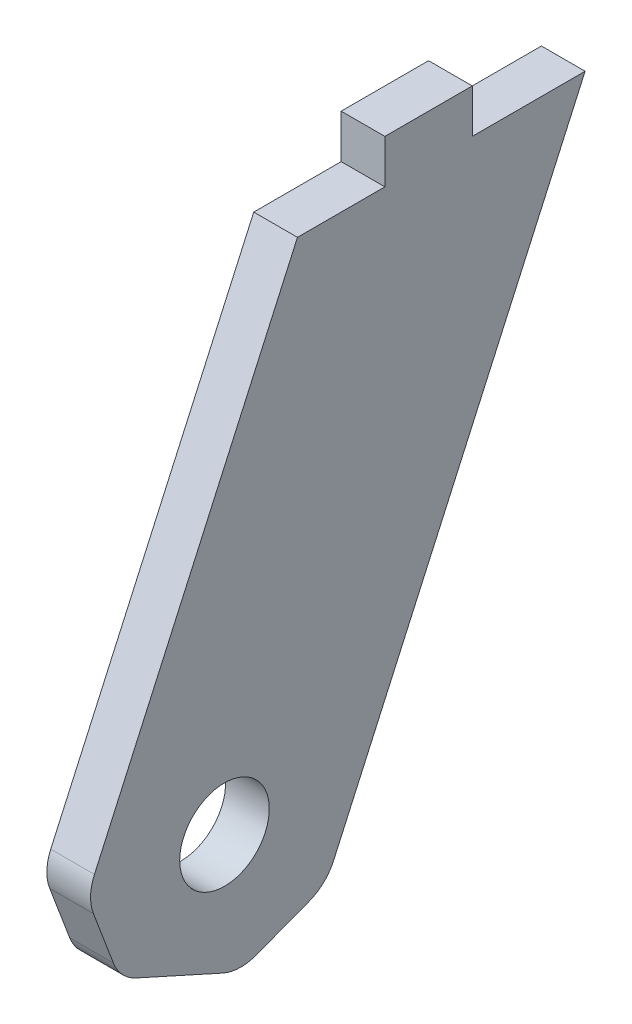
ISO-10303-21;
HEADER;
FILE_DESCRIPTION(('STEP AP214'),'2;1');
FILE_NAME('part.step','',(''),(''),'','','');
FILE_SCHEMA(('AUTOMOTIVE_DESIGN { 1 0 10303 214 1 1 1 1 }'));
ENDSEC;
DATA;
#1=APPLICATION_CONTEXT('core data for automotive mechanical design processes');
#2=APPLICATION_PROTOCOL_DEFINITION('international standard','automotive_design',2000,#1);
#3=PRODUCT_CONTEXT('',#1,'mechanical');
#4=PRODUCT('Part','Part','',(#3));
#5=PRODUCT_RELATED_PRODUCT_CATEGORY('part','',(#4));
#6=PRODUCT_DEFINITION_FORMATION('','',#4);
#7=PRODUCT_DEFINITION_CONTEXT('part definition',#1,'design');
#8=PRODUCT_DEFINITION('design','',#6,#7);
#9=PRODUCT_DEFINITION_SHAPE('','',#8);
#10=(LENGTH_UNIT() NAMED_UNIT(*) SI_UNIT(.MILLI.,.METRE.));
#11=(NAMED_UNIT(*) PLANE_ANGLE_UNIT() SI_UNIT($,.RADIAN.));
#12=(NAMED_UNIT(*) SI_UNIT($,.STERADIAN.) SOLID_ANGLE_UNIT());
#13=UNCERTAINTY_MEASURE_WITH_UNIT(LENGTH_MEASURE(1.E-05),#10,'distance_accuracy_value','');
#14=(GEOMETRIC_REPRESENTATION_CONTEXT(3) GLOBAL_UNCERTAINTY_ASSIGNED_CONTEXT((#13)) GLOBAL_UNIT_ASSIGNED_CONTEXT((#10,
#11,#12)) REPRESENTATION_CONTEXT('',''));
#15=CARTESIAN_POINT('',(0.,0.,0.));
#16=DIRECTION('',(0.,0.,1.));
#17=DIRECTION('',(1.,0.,0.));
#18=AXIS2_PLACEMENT_3D('',#15,#16,#17);
#19=CARTESIAN_POINT('',(665.,-480.,-565.908733529814));
#20=DIRECTION('',(0.,1.,0.));
#21=DIRECTION('',(0.,0.,1.));
#22=AXIS2_PLACEMENT_3D('',#19,#20,#21);
#23=PLANE('',#22);
#24=DIRECTION('',(0.,0.,1.));
#25=VECTOR('',#24,1.);
#26=CARTESIAN_POINT('',(675.,-480.,-565.908733529814));
#27=LINE('',#26,#25);
#28=CARTESIAN_POINT('',(675.,-480.,-520.091266470186));
#29=VERTEX_POINT('',#28);
#30=CARTESIAN_POINT('',(675.,-480.,-500.091266470186));
#31=VERTEX_POINT('',#30);
#32=EDGE_CURVE('E165',#29,#31,#27,.T.);
#33=ORIENTED_EDGE('',*,*,#32,.F.);
#34=CARTESIAN_POINT('',(675.,-480.,-520.091266470186));
#35=CARTESIAN_POINT('',(665.,-480.,-520.091266470186));
#36=B_SPLINE_CURVE_WITH_KNOTS('',1,(#34,#35),.UNSPECIFIED.,.F.,.F.,(2,2),(0.,0.166666666666667),.UNSPECIFIED.);
#37=CARTESIAN_POINT('',(665.,-480.,-520.091266470186));
#38=VERTEX_POINT('',#37);
#39=EDGE_CURVE('E153',#29,#38,#36,.T.);
#40=ORIENTED_EDGE('',*,*,#39,.T.);
#41=DIRECTION('',(0.,0.,1.));
#42=VECTOR('',#41,1.);
#43=CARTESIAN_POINT('',(665.,-480.,-565.908733529814));
#44=LINE('',#43,#42);
#45=CARTESIAN_POINT('',(665.,-480.,-500.091266470186));
#46=VERTEX_POINT('',#45);
#47=EDGE_CURVE('E163',#38,#46,#44,.T.);
#48=ORIENTED_EDGE('',*,*,#47,.T.);
#49=DIRECTION('',(1.,0.,0.));
#50=VECTOR('',#49,1.);
#51=CARTESIAN_POINT('',(665.,-480.,-500.091266470186));
#52=LINE('',#51,#50);
#53=EDGE_CURVE('E320',#46,#31,#52,.T.);
#54=ORIENTED_EDGE('',*,*,#53,.T.);
#55=EDGE_LOOP('',(#33,#40,#48,#54));
#56=FACE_BOUND('',#55,.T.);
#57=ADVANCED_FACE('F41',(#56),#23,.T.);
#58=CARTESIAN_POINT('',(665.,-480.,-565.908733529814));
#59=VERTEX_POINT('',#58);
#60=CARTESIAN_POINT('',(665.,-480.,-540.091266470186));
#61=VERTEX_POINT('',#60);
#62=EDGE_CURVE('E170',#59,#61,#44,.T.);
#63=ORIENTED_EDGE('',*,*,#62,.T.);
#64=CARTESIAN_POINT('',(665.,-480.,-540.091266470186));
#65=CARTESIAN_POINT('',(675.,-480.,-540.091266470186));
#66=B_SPLINE_CURVE_WITH_KNOTS('',1,(#64,#65),.UNSPECIFIED.,.F.,.F.,(2,2),(0.5,
0.666666666666667),.UNSPECIFIED.);
#67=CARTESIAN_POINT('',(675.,-480.,-540.091266470186));
#68=VERTEX_POINT('',#67);
#69=EDGE_CURVE('E159',#61,#68,#66,.T.);
#70=ORIENTED_EDGE('',*,*,#69,.T.);
#71=CARTESIAN_POINT('',(675.,-480.,-565.908733529814));
#72=VERTEX_POINT('',#71);
#73=EDGE_CURVE('E188',#72,#68,#27,.T.);
#74=ORIENTED_EDGE('',*,*,#73,.F.);
#75=DIRECTION('',(1.,0.,0.));
#76=VECTOR('',#75,1.);
#77=CARTESIAN_POINT('',(665.,-480.,-565.908733529814));
#78=LINE('',#77,#76);
#79=EDGE_CURVE('E182',#59,#72,#78,.T.);
#80=ORIENTED_EDGE('',*,*,#79,.F.);
#81=EDGE_LOOP('',(#63,#70,#74,#80));
#82=FACE_BOUND('',#81,.T.);
#83=ADVANCED_FACE('F233',(#82),#23,.T.);
#84=CARTESIAN_POINT('',(665.,-625.121848684689,-500.472395517835));
#85=DIRECTION('',(0.,-0.411051531423234,-0.911612109679668));
#86=DIRECTION('',(0.,0.911612109679668,-0.411051531423234));
#87=AXIS2_PLACEMENT_3D('',#84,#85,#86);
#88=PLANE('',#87);
#89=DIRECTION('',(0.,0.911612109679667,-0.411051531423234));
#90=VECTOR('',#89,1.);
#91=CARTESIAN_POINT('',(675.,-625.121848684689,-500.472395517835));
#92=LINE('',#91,#90);
#93=CARTESIAN_POINT('',(675.,-607.671646044965,-508.340799680681));
#94=VERTEX_POINT('',#93);
#95=EDGE_CURVE('E183',#94,#72,#92,.T.);
#96=ORIENTED_EDGE('',*,*,#95,.F.);
#97=DIRECTION('',(1.,0.,0.));
#98=VECTOR('',#97,1.);
#99=CARTESIAN_POINT('',(665.,-607.671646044965,-508.340799680681));
#100=LINE('',#99,#98);
#101=CARTESIAN_POINT('',(665.,-607.671646044965,-508.340799680681));
#102=VERTEX_POINT('',#101);
#103=EDGE_CURVE('E308',#94,#102,#100,.F.);
#104=ORIENTED_EDGE('',*,*,#103,.T.);
#105=DIRECTION('',(0.,0.911612109679667,-0.411051531423234));
#106=VECTOR('',#105,1.);
#107=CARTESIAN_POINT('',(665.,-625.121848684689,-500.472395517835));
#108=LINE('',#107,#106);
#109=EDGE_CURVE('E171',#102,#59,#108,.T.);
#110=ORIENTED_EDGE('',*,*,#109,.T.);
#111=ORIENTED_EDGE('',*,*,#79,.T.);
#112=EDGE_LOOP('',(#96,#104,#110,#111));
#113=FACE_BOUND('',#112,.T.);
#114=ADVANCED_FACE('F238',(#113),#88,.T.);
#115=CARTESIAN_POINT('',(665.,-600.458756799295,-445.775668937055));
#116=DIRECTION('',(0.,-0.911612109679667,0.411051531423235));
#117=DIRECTION('',(0.,-0.411051531423235,-0.911612109679667));
#118=AXIS2_PLACEMENT_3D('',#115,#116,#117);
#119=PLANE('',#118);
#120=DIRECTION('',(0.,-0.411051531423234,-0.911612109679667));
#121=VECTOR('',#120,1.);
#122=CARTESIAN_POINT('',(665.,-600.458756799295,-445.775668937055));
#123=LINE('',#122,#121);
#124=CARTESIAN_POINT('',(665.,-608.327160962141,-463.225871576779));
#125=VERTEX_POINT('',#124);
#126=CARTESIAN_POINT('',(665.,-617.253444521843,-483.022192878111));
#127=VERTEX_POINT('',#126);
#128=EDGE_CURVE('E179',#125,#127,#123,.T.);
#129=ORIENTED_EDGE('',*,*,#128,.T.);
#130=DIRECTION('',(-1.,0.,0.));
#131=VECTOR('',#130,1.);
#132=CARTESIAN_POINT('',(665.,-617.253444521843,-483.022192878111));
#133=LINE('',#132,#131);
#134=CARTESIAN_POINT('',(675.,-617.253444521843,-483.022192878111));
#135=VERTEX_POINT('',#134);
#136=EDGE_CURVE('E291',#127,#135,#133,.F.);
#137=ORIENTED_EDGE('',*,*,#136,.T.);
#138=DIRECTION('',(0.,-0.411051531423234,-0.911612109679667));
#139=VECTOR('',#138,1.);
#140=CARTESIAN_POINT('',(675.,-600.458756799295,-445.775668937055));
#141=LINE('',#140,#139);
#142=CARTESIAN_POINT('',(675.,-608.327160962141,-463.225871576779));
#143=VERTEX_POINT('',#142);
#144=EDGE_CURVE('E174',#143,#135,#141,.T.);
#145=ORIENTED_EDGE('',*,*,#144,.F.);
#146=DIRECTION('',(1.,0.,0.));
#147=VECTOR('',#146,1.);
#148=CARTESIAN_POINT('',(665.,-608.327160962141,-463.225871576779));
#149=LINE('',#148,#147);
#150=EDGE_CURVE('E278',#143,#125,#149,.F.);
#151=ORIENTED_EDGE('',*,*,#150,.T.);
#152=EDGE_LOOP('',(#129,#137,#145,#151));
#153=FACE_BOUND('',#152,.T.);
#154=ADVANCED_FACE('F246',(#153),#119,.T.);
#155=CARTESIAN_POINT('',(665.,-480.,-500.091266470186));
#156=DIRECTION('',(0.,0.411051531423234,0.911612109679668));
#157=DIRECTION('',(0.,-0.911612109679668,0.411051531423234));
#158=AXIS2_PLACEMENT_3D('',#155,#156,#157);
#159=PLANE('',#158);
#160=DIRECTION('',(0.,-0.911612109679668,0.411051531423234));
#161=VECTOR('',#160,1.);
#162=CARTESIAN_POINT('',(665.,-480.,-500.091266470186));
#163=LINE('',#162,#161);
#164=CARTESIAN_POINT('',(665.,-583.008554159571,-453.644073099901));
#165=VERTEX_POINT('',#164);
#166=EDGE_CURVE('E169',#46,#165,#163,.T.);
#167=ORIENTED_EDGE('',*,*,#166,.T.);
#168=DIRECTION('',(-1.,0.,0.));
#169=VECTOR('',#168,1.);
#170=CARTESIAN_POINT('',(665.,-583.008554159571,-453.644073099901));
#171=LINE('',#170,#169);
#172=CARTESIAN_POINT('',(675.,-583.008554159571,-453.644073099901));
#173=VERTEX_POINT('',#172);
#174=EDGE_CURVE('E12',#165,#173,#171,.F.);
#175=ORIENTED_EDGE('',*,*,#174,.T.);
#176=DIRECTION('',(0.,-0.911612109679668,0.411051531423234));
#177=VECTOR('',#176,1.);
#178=CARTESIAN_POINT('',(675.,-480.,-500.091266470186));
#179=LINE('',#178,#177);
#180=EDGE_CURVE('E337',#31,#173,#179,.T.);
#181=ORIENTED_EDGE('',*,*,#180,.F.);
#182=ORIENTED_EDGE('',*,*,#53,.F.);
#183=EDGE_LOOP('',(#167,#175,#181,#182));
#184=FACE_BOUND('',#183,.T.);
#185=ADVANCED_FACE('F242',(#184),#159,.T.);
#186=CARTESIAN_POINT('',(665.,0.,0.));
#187=DIRECTION('',(-1.,0.,0.));
#188=DIRECTION('',(0.,0.,1.));
#189=AXIS2_PLACEMENT_3D('',#186,#187,#188);
#190=PLANE('',#189);
#191=CARTESIAN_POINT('',(665.,-590.,-483.400320513026));
#192=DIRECTION('',(-1.,0.,0.));
#193=DIRECTION('',(0.,0.,1.));
#194=AXIS2_PLACEMENT_3D('',#191,#192,#193);
#195=CIRCLE('',#194,10.2499999999998);
#196=CARTESIAN_POINT('',(665.,-590.,-473.150320513026));
#197=VERTEX_POINT('',#196);
#198=EDGE_CURVE('E187',#197,#197,#195,.T.);
#199=ORIENTED_EDGE('',*,*,#198,.F.);
#200=EDGE_LOOP('',(#199));
#201=FACE_BOUND('',#200,.T.);
#202=DIRECTION('',(0.,0.353949779279786,-0.935264429852751));
#203=VECTOR('',#202,1.);
#204=CARTESIAN_POINT('',(665.,-702.561026692775,-265.883436161085));
#205=LINE('',#204,#203);
#206=CARTESIAN_POINT('',(665.,-612.91377502926,-502.764176376683));
#207=VERTEX_POINT('',#206);
#208=CARTESIAN_POINT('',(665.,-617.489967723574,-490.672205985142));
#209=VERTEX_POINT('',#208);
#210=EDGE_CURVE('E329',#207,#209,#205,.F.);
#211=ORIENTED_EDGE('',*,*,#210,.T.);
#212=CARTESIAN_POINT('',(665.,-608.137323425046,-487.132708192344));
#213=DIRECTION('',(-1.,0.,0.));
#214=DIRECTION('',(0.,0.,1.));
#215=AXIS2_PLACEMENT_3D('',#212,#213,#214);
#216=CIRCLE('',#215,10.);
#217=EDGE_CURVE('E306',#209,#127,#216,.T.);
#218=ORIENTED_EDGE('',*,*,#217,.T.);
#219=ORIENTED_EDGE('',*,*,#128,.F.);
#220=CARTESIAN_POINT('',(665.,-599.211039865344,-467.336386891011));
#221=DIRECTION('',(-1.,0.,0.));
#222=DIRECTION('',(0.,0.,1.));
#223=AXIS2_PLACEMENT_3D('',#220,#221,#222);
#224=CIRCLE('',#223,10.);
#225=CARTESIAN_POINT('',(665.,-602.750537658142,-457.983742592484));
#226=VERTEX_POINT('',#225);
#227=EDGE_CURVE('E302',#125,#226,#224,.T.);
#228=ORIENTED_EDGE('',*,*,#227,.T.);
#229=DIRECTION('',(0.,-0.935264429852752,-0.353949779279783));
#230=VECTOR('',#229,1.);
#231=CARTESIAN_POINT('',(665.,76.0965423055881,-201.074823095014));
#232=LINE('',#231,#230);
#233=CARTESIAN_POINT('',(665.,-590.658567266601,-453.40754989817));
#234=VERTEX_POINT('',#233);
#235=EDGE_CURVE('E317',#226,#234,#232,.F.);
#236=ORIENTED_EDGE('',*,*,#235,.T.);
#237=CARTESIAN_POINT('',(665.,-587.119069473803,-462.760194196698));
#238=DIRECTION('',(-1.,0.,0.));
#239=DIRECTION('',(0.,0.,1.));
#240=AXIS2_PLACEMENT_3D('',#237,#238,#239);
#241=CIRCLE('',#240,10.);
#242=EDGE_CURVE('E66',#234,#165,#241,.T.);
#243=ORIENTED_EDGE('',*,*,#242,.T.);
#244=ORIENTED_EDGE('',*,*,#166,.F.);
#245=ORIENTED_EDGE('',*,*,#47,.F.);
#246=DIRECTION('',(0.,-1.,0.));
#247=VECTOR('',#246,1.);
#248=CARTESIAN_POINT('',(665.,-460.,-520.091266470186));
#249=LINE('',#248,#247);
#250=CARTESIAN_POINT('',(665.,-470.,-520.091266470186));
#251=VERTEX_POINT('',#250);
#252=EDGE_CURVE('E149',#251,#38,#249,.T.);
#253=ORIENTED_EDGE('',*,*,#252,.F.);
#254=DIRECTION('',(0.,0.,1.));
#255=VECTOR('',#254,1.);
#256=CARTESIAN_POINT('',(665.,-470.,-520.091266470186));
#257=LINE('',#256,#255);
#258=CARTESIAN_POINT('',(665.,-470.,-540.091266470186));
#259=VERTEX_POINT('',#258);
#260=EDGE_CURVE('E208',#259,#251,#257,.T.);
#261=ORIENTED_EDGE('',*,*,#260,.F.);
#262=DIRECTION('',(0.,-1.,0.));
#263=VECTOR('',#262,1.);
#264=CARTESIAN_POINT('',(665.,-460.,-540.091266470186));
#265=LINE('',#264,#263);
#266=EDGE_CURVE('E158',#259,#61,#265,.T.);
#267=ORIENTED_EDGE('',*,*,#266,.T.);
#268=ORIENTED_EDGE('',*,*,#62,.F.);
#269=ORIENTED_EDGE('',*,*,#109,.F.);
#270=CARTESIAN_POINT('',(665.,-603.561130730732,-499.224678583885));
#271=DIRECTION('',(-1.,0.,0.));
#272=DIRECTION('',(0.,0.,1.));
#273=AXIS2_PLACEMENT_3D('',#270,#271,#272);
#274=CIRCLE('',#273,10.);
#275=EDGE_CURVE('E304',#102,#207,#274,.T.);
#276=ORIENTED_EDGE('',*,*,#275,.T.);
#277=EDGE_LOOP('',(#211,#218,#219,#228,#236,#243,#244,#245,#253,#261,#267,#268,#269,#276));
#278=FACE_BOUND('',#277,.T.);
#279=ADVANCED_FACE('F168',(#201,#278),#190,.T.);
#280=CARTESIAN_POINT('',(675.,0.,0.));
#281=DIRECTION('',(-1.,0.,0.));
#282=DIRECTION('',(0.,0.,1.));
#283=AXIS2_PLACEMENT_3D('',#280,#281,#282);
#284=PLANE('',#283);
#285=CARTESIAN_POINT('',(675.,-590.,-483.400320513026));
#286=DIRECTION('',(-1.,0.,0.));
#287=DIRECTION('',(0.,0.,1.));
#288=AXIS2_PLACEMENT_3D('',#285,#286,#287);
#289=CIRCLE('',#288,10.2499999999998);
#290=CARTESIAN_POINT('',(675.,-590.,-473.150320513026));
#291=VERTEX_POINT('',#290);
#292=EDGE_CURVE('E45',#291,#291,#289,.T.);
#293=ORIENTED_EDGE('',*,*,#292,.T.);
#294=EDGE_LOOP('',(#293));
#295=FACE_BOUND('',#294,.T.);
#296=ORIENTED_EDGE('',*,*,#144,.T.);
#297=CARTESIAN_POINT('',(675.,-608.137323425046,-487.132708192344));
#298=DIRECTION('',(-1.,0.,0.));
#299=DIRECTION('',(0.,0.,1.));
#300=AXIS2_PLACEMENT_3D('',#297,#298,#299);
#301=CIRCLE('',#300,10.);
#302=CARTESIAN_POINT('',(675.,-617.489967723574,-490.672205985142));
#303=VERTEX_POINT('',#302);
#304=EDGE_CURVE('E288',#135,#303,#301,.F.);
#305=ORIENTED_EDGE('',*,*,#304,.T.);
#306=DIRECTION('',(0.,-0.353949779279786,0.935264429852751));
#307=VECTOR('',#306,1.);
#308=CARTESIAN_POINT('',(675.,-618.95607571334,-486.79821387264));
#309=LINE('',#308,#307);
#310=CARTESIAN_POINT('',(675.,-612.91377502926,-502.764176376682));
#311=VERTEX_POINT('',#310);
#312=EDGE_CURVE('E319',#303,#311,#309,.F.);
#313=ORIENTED_EDGE('',*,*,#312,.T.);
#314=CARTESIAN_POINT('',(675.,-603.561130730732,-499.224678583885));
#315=DIRECTION('',(-1.,0.,0.));
#316=DIRECTION('',(0.,0.,1.));
#317=AXIS2_PLACEMENT_3D('',#314,#315,#316);
#318=CIRCLE('',#317,10.);
#319=EDGE_CURVE('E283',#311,#94,#318,.F.);
#320=ORIENTED_EDGE('',*,*,#319,.T.);
#321=ORIENTED_EDGE('',*,*,#95,.T.);
#322=ORIENTED_EDGE('',*,*,#73,.T.);
#323=DIRECTION('',(0.,-1.,0.));
#324=VECTOR('',#323,1.);
#325=CARTESIAN_POINT('',(675.,-460.,-540.091266470186));
#326=LINE('',#325,#324);
#327=CARTESIAN_POINT('',(675.,-470.,-540.091266470186));
#328=VERTEX_POINT('',#327);
#329=EDGE_CURVE('E58',#328,#68,#326,.T.);
#330=ORIENTED_EDGE('',*,*,#329,.F.);
#331=DIRECTION('',(0.,0.,-1.));
#332=VECTOR('',#331,1.);
#333=CARTESIAN_POINT('',(675.,-470.,-540.091266470186));
#334=LINE('',#333,#332);
#335=CARTESIAN_POINT('',(675.,-470.,-520.091266470186));
#336=VERTEX_POINT('',#335);
#337=EDGE_CURVE('E372',#336,#328,#334,.T.);
#338=ORIENTED_EDGE('',*,*,#337,.F.);
#339=DIRECTION('',(0.,-1.,0.));
#340=VECTOR('',#339,1.);
#341=CARTESIAN_POINT('',(675.,-460.,-520.091266470186));
#342=LINE('',#341,#340);
#343=EDGE_CURVE('E204',#336,#29,#342,.T.);
#344=ORIENTED_EDGE('',*,*,#343,.T.);
#345=ORIENTED_EDGE('',*,*,#32,.T.);
#346=ORIENTED_EDGE('',*,*,#180,.T.);
#347=CARTESIAN_POINT('',(675.,-587.119069473803,-462.760194196698));
#348=DIRECTION('',(-1.,0.,0.));
#349=DIRECTION('',(0.,0.,1.));
#350=AXIS2_PLACEMENT_3D('',#347,#348,#349);
#351=CIRCLE('',#350,10.);
#352=CARTESIAN_POINT('',(675.,-590.658567266601,-453.40754989817));
#353=VERTEX_POINT('',#352);
#354=EDGE_CURVE('E284',#173,#353,#351,.F.);
#355=ORIENTED_EDGE('',*,*,#354,.T.);
#356=DIRECTION('',(0.,0.935264429852752,0.353949779279783));
#357=VECTOR('',#356,1.);
#358=CARTESIAN_POINT('',(675.,-586.7845751541,-451.941441908404));
#359=LINE('',#358,#357);
#360=CARTESIAN_POINT('',(675.,-602.750537658142,-457.983742592484));
#361=VERTEX_POINT('',#360);
#362=EDGE_CURVE('E315',#353,#361,#359,.F.);
#363=ORIENTED_EDGE('',*,*,#362,.T.);
#364=CARTESIAN_POINT('',(675.,-599.211039865344,-467.336386891011));
#365=DIRECTION('',(-1.,0.,0.));
#366=DIRECTION('',(0.,0.,1.));
#367=AXIS2_PLACEMENT_3D('',#364,#365,#366);
#368=CIRCLE('',#367,10.);
#369=EDGE_CURVE('E276',#361,#143,#368,.F.);
#370=ORIENTED_EDGE('',*,*,#369,.T.);
#371=EDGE_LOOP('',(#296,#305,#313,#320,#321,#322,#330,#338,#344,#345,#346,#355,#363,#370));
#372=FACE_BOUND('',#371,.T.);
#373=ADVANCED_FACE('F217',(#295,#372),#284,.F.);
#374=CARTESIAN_POINT('',(665.,-618.95607571334,-486.79821387264));
#375=DIRECTION('',(0.,0.935264429852751,0.353949779279786));
#376=DIRECTION('',(1.,0.,0.));
#377=AXIS2_PLACEMENT_3D('',#374,#375,#376);
#378=PLANE('',#377);
#379=ORIENTED_EDGE('',*,*,#312,.F.);
#380=DIRECTION('',(1.,0.,0.));
#381=VECTOR('',#380,1.);
#382=CARTESIAN_POINT('',(665.,-617.489967723574,-490.672205985142));
#383=LINE('',#382,#381);
#384=EDGE_CURVE('E299',#303,#209,#383,.F.);
#385=ORIENTED_EDGE('',*,*,#384,.T.);
#386=ORIENTED_EDGE('',*,*,#210,.F.);
#387=DIRECTION('',(-1.,0.,0.));
#388=VECTOR('',#387,1.);
#389=CARTESIAN_POINT('',(665.,-612.91377502926,-502.764176376682));
#390=LINE('',#389,#388);
#391=EDGE_CURVE('E297',#207,#311,#390,.F.);
#392=ORIENTED_EDGE('',*,*,#391,.T.);
#393=EDGE_LOOP('',(#379,#385,#386,#392));
#394=FACE_BOUND('',#393,.T.);
#395=ADVANCED_FACE('F249',(#394),#378,.F.);
#396=CARTESIAN_POINT('',(665.,-586.7845751541,-451.941441908404));
#397=DIRECTION('',(0.,0.353949779279783,-0.935264429852752));
#398=DIRECTION('',(1.,0.,0.));
#399=AXIS2_PLACEMENT_3D('',#396,#397,#398);
#400=PLANE('',#399);
#401=ORIENTED_EDGE('',*,*,#235,.F.);
#402=DIRECTION('',(-1.,0.,0.));
#403=VECTOR('',#402,1.);
#404=CARTESIAN_POINT('',(665.,-602.750537658142,-457.983742592484));
#405=LINE('',#404,#403);
#406=EDGE_CURVE('E51',#226,#361,#405,.F.);
#407=ORIENTED_EDGE('',*,*,#406,.T.);
#408=ORIENTED_EDGE('',*,*,#362,.F.);
#409=DIRECTION('',(1.,0.,0.));
#410=VECTOR('',#409,1.);
#411=CARTESIAN_POINT('',(665.,-590.658567266601,-453.40754989817));
#412=LINE('',#411,#410);
#413=EDGE_CURVE('E311',#353,#234,#412,.F.);
#414=ORIENTED_EDGE('',*,*,#413,.T.);
#415=EDGE_LOOP('',(#401,#407,#408,#414));
#416=FACE_BOUND('',#415,.T.);
#417=ADVANCED_FACE('F255',(#416),#400,.F.);
#418=CARTESIAN_POINT('',(665.,-608.137323425046,-487.132708192344));
#419=DIRECTION('',(-1.,0.,0.));
#420=DIRECTION('',(0.,0.,1.));
#421=AXIS2_PLACEMENT_3D('',#418,#419,#420);
#422=CYLINDRICAL_SURFACE('',#421,10.);
#423=ORIENTED_EDGE('',*,*,#217,.F.);
#424=ORIENTED_EDGE('',*,*,#384,.F.);
#425=ORIENTED_EDGE('',*,*,#304,.F.);
#426=ORIENTED_EDGE('',*,*,#136,.F.);
#427=EDGE_LOOP('',(#423,#424,#425,#426));
#428=FACE_BOUND('',#427,.T.);
#429=ADVANCED_FACE('F261',(#428),#422,.T.);
#430=CARTESIAN_POINT('',(665.,-603.561130730732,-499.224678583885));
#431=DIRECTION('',(1.,0.,0.));
#432=DIRECTION('',(0.,0.,-1.));
#433=AXIS2_PLACEMENT_3D('',#430,#431,#432);
#434=CYLINDRICAL_SURFACE('',#433,10.);
#435=ORIENTED_EDGE('',*,*,#319,.F.);
#436=ORIENTED_EDGE('',*,*,#391,.F.);
#437=ORIENTED_EDGE('',*,*,#275,.F.);
#438=ORIENTED_EDGE('',*,*,#103,.F.);
#439=EDGE_LOOP('',(#435,#436,#437,#438));
#440=FACE_BOUND('',#439,.T.);
#441=ADVANCED_FACE('F265',(#440),#434,.T.);
#442=CARTESIAN_POINT('',(665.,-599.211039865344,-467.336386891011));
#443=DIRECTION('',(1.,0.,0.));
#444=DIRECTION('',(0.,0.,-1.));
#445=AXIS2_PLACEMENT_3D('',#442,#443,#444);
#446=CYLINDRICAL_SURFACE('',#445,10.);
#447=ORIENTED_EDGE('',*,*,#369,.F.);
#448=ORIENTED_EDGE('',*,*,#406,.F.);
#449=ORIENTED_EDGE('',*,*,#227,.F.);
#450=ORIENTED_EDGE('',*,*,#150,.F.);
#451=EDGE_LOOP('',(#447,#448,#449,#450));
#452=FACE_BOUND('',#451,.T.);
#453=ADVANCED_FACE('F229',(#452),#446,.T.);
#454=CARTESIAN_POINT('',(665.,-587.119069473803,-462.760194196698));
#455=DIRECTION('',(-1.,0.,0.));
#456=DIRECTION('',(0.,0.,1.));
#457=AXIS2_PLACEMENT_3D('',#454,#455,#456);
#458=CYLINDRICAL_SURFACE('',#457,10.);
#459=ORIENTED_EDGE('',*,*,#242,.F.);
#460=ORIENTED_EDGE('',*,*,#413,.F.);
#461=ORIENTED_EDGE('',*,*,#354,.F.);
#462=ORIENTED_EDGE('',*,*,#174,.F.);
#463=EDGE_LOOP('',(#459,#460,#461,#462));
#464=FACE_BOUND('',#463,.T.);
#465=ADVANCED_FACE('F43',(#464),#458,.T.);
#466=CARTESIAN_POINT('',(735.,-590.,-483.400320513026));
#467=DIRECTION('',(1.,0.,0.));
#468=DIRECTION('',(0.,0.,-1.));
#469=AXIS2_PLACEMENT_3D('',#466,#467,#468);
#470=CYLINDRICAL_SURFACE('',#469,10.2499999999998);
#471=ORIENTED_EDGE('',*,*,#198,.T.);
#472=EDGE_LOOP('',(#471));
#473=FACE_BOUND('',#472,.T.);
#474=ORIENTED_EDGE('',*,*,#292,.F.);
#475=EDGE_LOOP('',(#474));
#476=FACE_BOUND('',#475,.T.);
#477=ADVANCED_FACE('F220',(#473,#476),#470,.F.);
#478=CARTESIAN_POINT('',(675.,-460.,-520.091266470186));
#479=DIRECTION('',(0.,0.,1.));
#480=DIRECTION('',(1.,0.,0.));
#481=AXIS2_PLACEMENT_3D('',#478,#479,#480);
#482=PLANE('',#481);
#483=DIRECTION('',(1.,0.,0.));
#484=VECTOR('',#483,1.);
#485=CARTESIAN_POINT('',(675.,-470.,-520.091266470186));
#486=LINE('',#485,#484);
#487=EDGE_CURVE('E155',#251,#336,#486,.T.);
#488=ORIENTED_EDGE('',*,*,#487,.F.);
#489=ORIENTED_EDGE('',*,*,#252,.T.);
#490=ORIENTED_EDGE('',*,*,#39,.F.);
#491=ORIENTED_EDGE('',*,*,#343,.F.);
#492=EDGE_LOOP('',(#488,#489,#490,#491));
#493=FACE_BOUND('',#492,.T.);
#494=ADVANCED_FACE('F151',(#493),#482,.T.);
#495=CARTESIAN_POINT('',(665.,-460.,-540.091266470186));
#496=DIRECTION('',(0.,0.,-1.));
#497=DIRECTION('',(-1.,0.,0.));
#498=AXIS2_PLACEMENT_3D('',#495,#496,#497);
#499=PLANE('',#498);
#500=DIRECTION('',(-1.,0.,0.));
#501=VECTOR('',#500,1.);
#502=CARTESIAN_POINT('',(665.,-470.,-540.091266470186));
#503=LINE('',#502,#501);
#504=EDGE_CURVE('E376',#328,#259,#503,.T.);
#505=ORIENTED_EDGE('',*,*,#504,.F.);
#506=ORIENTED_EDGE('',*,*,#329,.T.);
#507=ORIENTED_EDGE('',*,*,#69,.F.);
#508=ORIENTED_EDGE('',*,*,#266,.F.);
#509=EDGE_LOOP('',(#505,#506,#507,#508));
#510=FACE_BOUND('',#509,.T.);
#511=ADVANCED_FACE('F227',(#510),#499,.T.);
#512=CARTESIAN_POINT('',(0.,-470.,0.));
#513=DIRECTION('',(0.,-1.,0.));
#514=DIRECTION('',(0.,0.,-1.));
#515=AXIS2_PLACEMENT_3D('',#512,#513,#514);
#516=PLANE('',#515);
#517=ORIENTED_EDGE('',*,*,#487,.T.);
#518=ORIENTED_EDGE('',*,*,#337,.T.);
#519=ORIENTED_EDGE('',*,*,#504,.T.);
#520=ORIENTED_EDGE('',*,*,#260,.T.);
#521=EDGE_LOOP('',(#517,#518,#519,#520));
#522=FACE_BOUND('',#521,.T.);
#523=ADVANCED_FACE('F378',(#522),#516,.F.);
#524=CLOSED_SHELL('',(#57,#83,#114,#154,#185,#279,#373,#395,#417,#429,#441,#453,#465,#477,#494,
#511,#523));
#525=MANIFOLD_SOLID_BREP('B2',#524);
#526=ADVANCED_BREP_SHAPE_REPRESENTATION('',(#18,#525),#14);
#527=SHAPE_DEFINITION_REPRESENTATION(#9,#526);
ENDSEC;
END-ISO-10303-21;
